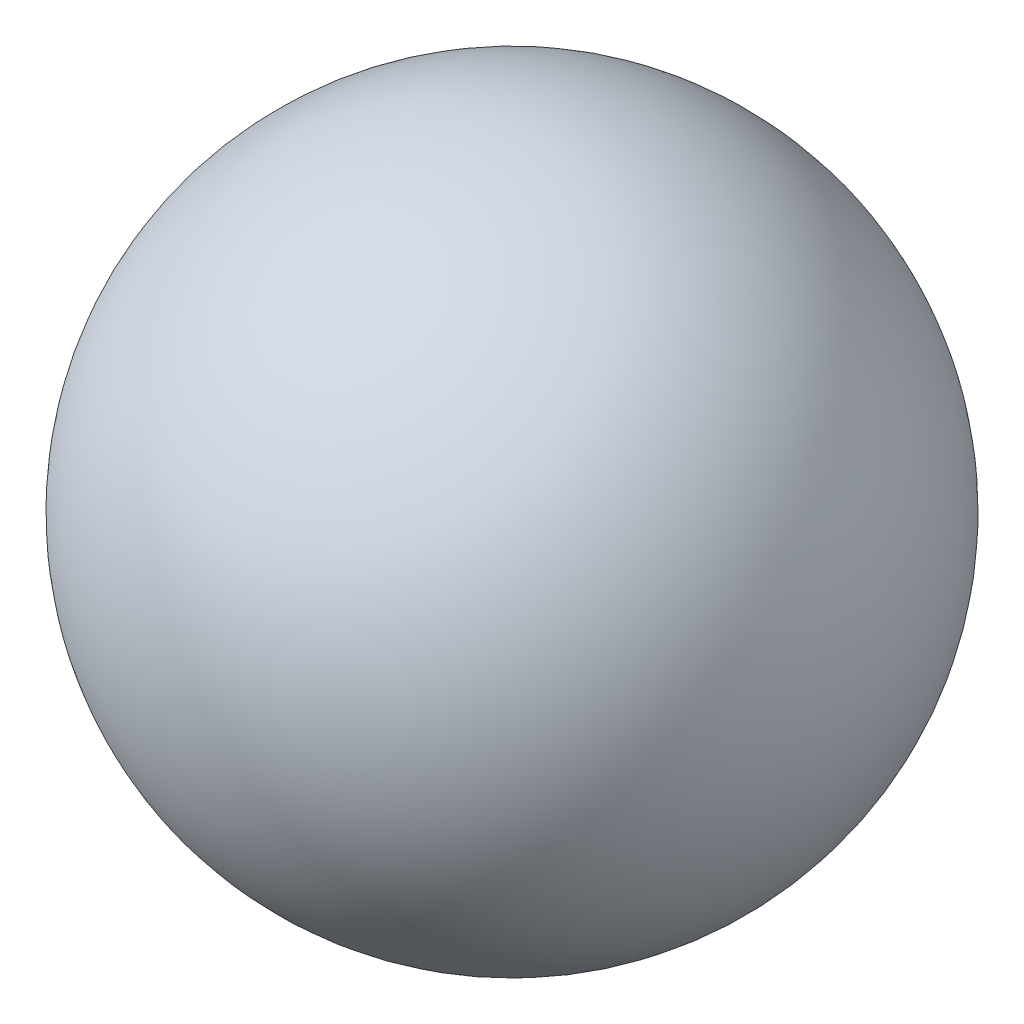
ISO-10303-21;
HEADER;
FILE_DESCRIPTION(('STEP AP214'),'2;1');
FILE_NAME('part.step','',(''),(''),'','','');
FILE_SCHEMA(('AUTOMOTIVE_DESIGN { 1 0 10303 214 1 1 1 1 }'));
ENDSEC;
DATA;
#1=APPLICATION_CONTEXT('core data for automotive mechanical design processes');
#2=APPLICATION_PROTOCOL_DEFINITION('international standard','automotive_design',2000,#1);
#3=PRODUCT_CONTEXT('',#1,'mechanical');
#4=PRODUCT('Part','Part','',(#3));
#5=PRODUCT_RELATED_PRODUCT_CATEGORY('part','',(#4));
#6=PRODUCT_DEFINITION_FORMATION('','',#4);
#7=PRODUCT_DEFINITION_CONTEXT('part definition',#1,'design');
#8=PRODUCT_DEFINITION('design','',#6,#7);
#9=PRODUCT_DEFINITION_SHAPE('','',#8);
#10=(LENGTH_UNIT() NAMED_UNIT(*) SI_UNIT(.MILLI.,.METRE.));
#11=(NAMED_UNIT(*) PLANE_ANGLE_UNIT() SI_UNIT($,.RADIAN.));
#12=(NAMED_UNIT(*) SI_UNIT($,.STERADIAN.) SOLID_ANGLE_UNIT());
#13=UNCERTAINTY_MEASURE_WITH_UNIT(LENGTH_MEASURE(1.E-05),#10,'distance_accuracy_value','');
#14=(GEOMETRIC_REPRESENTATION_CONTEXT(3) GLOBAL_UNCERTAINTY_ASSIGNED_CONTEXT((#13)) GLOBAL_UNIT_ASSIGNED_CONTEXT((#10,
#11,#12)) REPRESENTATION_CONTEXT('',''));
#15=CARTESIAN_POINT('',(0.,0.,0.));
#16=DIRECTION('',(0.,0.,1.));
#17=DIRECTION('',(1.,0.,0.));
#18=AXIS2_PLACEMENT_3D('',#15,#16,#17);
#19=CARTESIAN_POINT('',(-8.88005749866254,-2.,-7.69461362385709));
#20=DIRECTION('',(0.,0.,1.));
#21=DIRECTION('',(1.,0.,0.));
#22=AXIS2_PLACEMENT_3D('',#19,#20,#21);
#23=SPHERICAL_SURFACE('',#22,1.05);
#24=CARTESIAN_POINT('',(-8.88005749866254,-2.,-6.64461362385709));
#25=VERTEX_POINT('',#24);
#26=VERTEX_LOOP('',#25);
#27=FACE_BOUND('',#26,.T.);
#28=ADVANCED_FACE('F13',(#27),#23,.T.);
#29=CLOSED_SHELL('',(#28));
#30=MANIFOLD_SOLID_BREP('B1',#29);
#31=ADVANCED_BREP_SHAPE_REPRESENTATION('',(#18,#30),#14);
#32=SHAPE_DEFINITION_REPRESENTATION(#9,#31);
ENDSEC;
END-ISO-10303-21;
